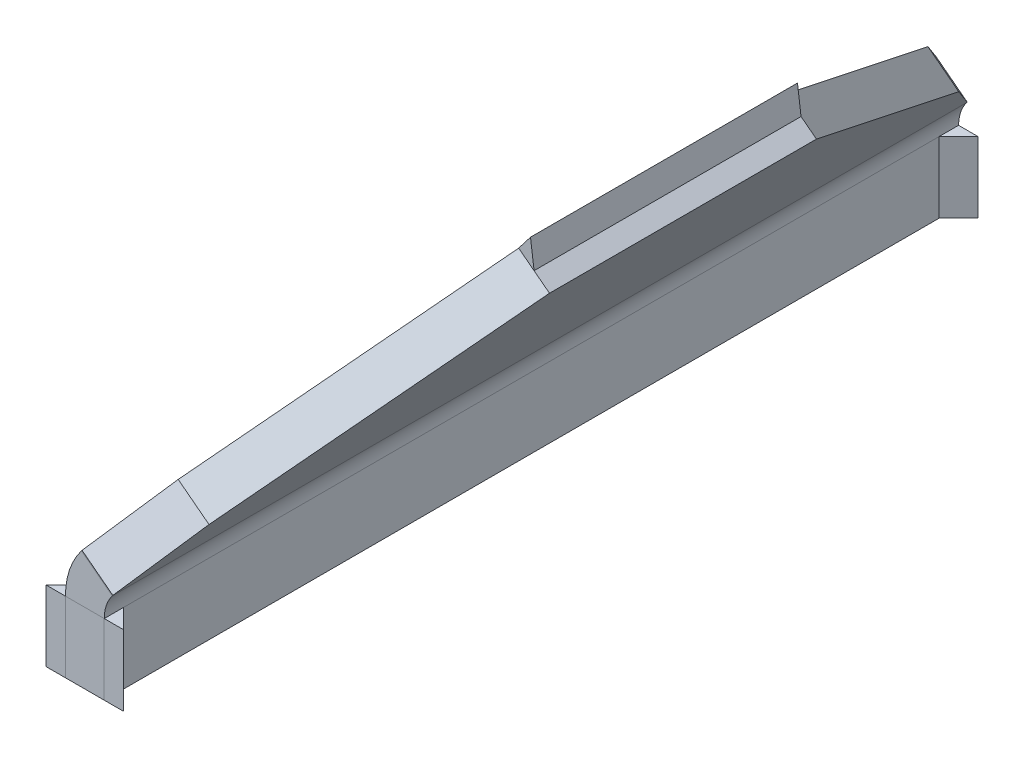
ISO-10303-21;
HEADER;
FILE_DESCRIPTION(('STEP AP214'),'2;1');
FILE_NAME('part.step','',(''),(''),'','','');
FILE_SCHEMA(('AUTOMOTIVE_DESIGN { 1 0 10303 214 1 1 1 1 }'));
ENDSEC;
DATA;
#1=APPLICATION_CONTEXT('core data for automotive mechanical design processes');
#2=APPLICATION_PROTOCOL_DEFINITION('international standard','automotive_design',2000,#1);
#3=PRODUCT_CONTEXT('',#1,'mechanical');
#4=PRODUCT('Part','Part','',(#3));
#5=PRODUCT_RELATED_PRODUCT_CATEGORY('part','',(#4));
#6=PRODUCT_DEFINITION_FORMATION('','',#4);
#7=PRODUCT_DEFINITION_CONTEXT('part definition',#1,'design');
#8=PRODUCT_DEFINITION('design','',#6,#7);
#9=PRODUCT_DEFINITION_SHAPE('','',#8);
#10=(LENGTH_UNIT() NAMED_UNIT(*) SI_UNIT(.MILLI.,.METRE.));
#11=(NAMED_UNIT(*) PLANE_ANGLE_UNIT() SI_UNIT($,.RADIAN.));
#12=(NAMED_UNIT(*) SI_UNIT($,.STERADIAN.) SOLID_ANGLE_UNIT());
#13=UNCERTAINTY_MEASURE_WITH_UNIT(LENGTH_MEASURE(1.E-05),#10,'distance_accuracy_value','');
#14=(GEOMETRIC_REPRESENTATION_CONTEXT(3) GLOBAL_UNCERTAINTY_ASSIGNED_CONTEXT((#13)) GLOBAL_UNIT_ASSIGNED_CONTEXT((#10,
#11,#12)) REPRESENTATION_CONTEXT('',''));
#15=CARTESIAN_POINT('',(0.,0.,0.));
#16=DIRECTION('',(0.,0.,1.));
#17=DIRECTION('',(1.,0.,0.));
#18=AXIS2_PLACEMENT_3D('',#15,#16,#17);
#19=CARTESIAN_POINT('',(0.,7.28436592909285,-42.));
#20=DIRECTION('',(-0.707106781186548,0.,0.707106781186547));
#21=DIRECTION('',(0.707106781186547,0.,0.707106781186548));
#22=AXIS2_PLACEMENT_3D('',#19,#20,#21);
#23=PLANE('',#22);
#24=DIRECTION('',(-0.707106781186547,0.,-0.707106781186548));
#25=VECTOR('',#24,1.);
#26=CARTESIAN_POINT('',(0.,-1.38777878078145E-13,-42.));
#27=LINE('',#26,#25);
#28=CARTESIAN_POINT('',(0.,-1.38777878078145E-13,-42.));
#29=VERTEX_POINT('',#28);
#30=CARTESIAN_POINT('',(-2.,0.,-44.));
#31=VERTEX_POINT('',#30);
#32=EDGE_CURVE('E101',#29,#31,#27,.T.);
#33=ORIENTED_EDGE('',*,*,#32,.F.);
#34=DIRECTION('',(0.,-1.,0.));
#35=VECTOR('',#34,1.);
#36=CARTESIAN_POINT('',(0.,7.28436592909285,-42.));
#37=LINE('',#36,#35);
#38=CARTESIAN_POINT('',(0.,7.28436592909285,-42.));
#39=VERTEX_POINT('',#38);
#40=EDGE_CURVE('E12',#39,#29,#37,.T.);
#41=ORIENTED_EDGE('',*,*,#40,.F.);
#42=DIRECTION('',(-0.707106781186547,0.,-0.707106781186548));
#43=VECTOR('',#42,1.);
#44=CARTESIAN_POINT('',(0.,7.28436592909285,-42.));
#45=LINE('',#44,#43);
#46=CARTESIAN_POINT('',(-1.99999999999999,7.28436592909298,-44.));
#47=VERTEX_POINT('',#46);
#48=EDGE_CURVE('E93',#39,#47,#45,.T.);
#49=ORIENTED_EDGE('',*,*,#48,.T.);
#50=DIRECTION('',(0.,-1.,0.));
#51=VECTOR('',#50,1.);
#52=CARTESIAN_POINT('',(-1.99999999999999,7.28436592909298,-44.));
#53=LINE('',#52,#51);
#54=EDGE_CURVE('E52',#47,#31,#53,.T.);
#55=ORIENTED_EDGE('',*,*,#54,.T.);
#56=EDGE_LOOP('',(#33,#41,#49,#55));
#57=FACE_BOUND('',#56,.T.);
#58=ADVANCED_FACE('F49',(#57),#23,.T.);
#59=CARTESIAN_POINT('',(0.,7.28436592909298,-44.));
#60=DIRECTION('',(1.,0.,0.));
#61=DIRECTION('',(0.,0.,-1.));
#62=AXIS2_PLACEMENT_3D('',#59,#60,#61);
#63=PLANE('',#62);
#64=DIRECTION('',(0.,0.,1.));
#65=VECTOR('',#64,1.);
#66=CARTESIAN_POINT('',(0.,-1.38777878078145E-13,-44.));
#67=LINE('',#66,#65);
#68=CARTESIAN_POINT('',(0.,-1.38777878078145E-13,-44.));
#69=VERTEX_POINT('',#68);
#70=EDGE_CURVE('E95',#69,#29,#67,.T.);
#71=ORIENTED_EDGE('',*,*,#70,.F.);
#72=DIRECTION('',(0.,-1.,0.));
#73=VECTOR('',#72,1.);
#74=CARTESIAN_POINT('',(0.,7.28436592909298,-44.));
#75=LINE('',#74,#73);
#76=CARTESIAN_POINT('',(0.,7.28436592909298,-44.));
#77=VERTEX_POINT('',#76);
#78=EDGE_CURVE('E58',#77,#69,#75,.T.);
#79=ORIENTED_EDGE('',*,*,#78,.F.);
#80=DIRECTION('',(0.,0.,1.));
#81=VECTOR('',#80,1.);
#82=CARTESIAN_POINT('',(0.,7.28436592909298,-44.));
#83=LINE('',#82,#81);
#84=EDGE_CURVE('E90',#77,#39,#83,.T.);
#85=ORIENTED_EDGE('',*,*,#84,.T.);
#86=ORIENTED_EDGE('',*,*,#40,.T.);
#87=EDGE_LOOP('',(#71,#79,#85,#86));
#88=FACE_BOUND('',#87,.T.);
#89=ADVANCED_FACE('F105',(#88),#63,.T.);
#90=CARTESIAN_POINT('',(-1.99999999999999,7.28436592909298,-44.));
#91=DIRECTION('',(0.,0.,-1.));
#92=DIRECTION('',(-1.,0.,0.));
#93=AXIS2_PLACEMENT_3D('',#90,#91,#92);
#94=PLANE('',#93);
#95=DIRECTION('',(1.,0.,0.));
#96=VECTOR('',#95,1.);
#97=CARTESIAN_POINT('',(-2.,0.,-44.));
#98=LINE('',#97,#96);
#99=EDGE_CURVE('E88',#31,#69,#98,.T.);
#100=ORIENTED_EDGE('',*,*,#99,.F.);
#101=ORIENTED_EDGE('',*,*,#54,.F.);
#102=DIRECTION('',(1.,0.,0.));
#103=VECTOR('',#102,1.);
#104=CARTESIAN_POINT('',(-1.99999999999999,7.28436592909298,-44.));
#105=LINE('',#104,#103);
#106=EDGE_CURVE('E86',#47,#77,#105,.T.);
#107=ORIENTED_EDGE('',*,*,#106,.T.);
#108=ORIENTED_EDGE('',*,*,#78,.T.);
#109=EDGE_LOOP('',(#100,#101,#107,#108));
#110=FACE_BOUND('',#109,.T.);
#111=ADVANCED_FACE('F85',(#110),#94,.T.);
#112=CARTESIAN_POINT('',(-1.99999999999999,7.28436592909298,-44.));
#113=DIRECTION('',(0.,-1.,0.));
#114=DIRECTION('',(0.,0.,-1.));
#115=AXIS2_PLACEMENT_3D('',#112,#113,#114);
#116=PLANE('',#115);
#117=ORIENTED_EDGE('',*,*,#48,.F.);
#118=ORIENTED_EDGE('',*,*,#84,.F.);
#119=ORIENTED_EDGE('',*,*,#106,.F.);
#120=EDGE_LOOP('',(#117,#118,#119));
#121=FACE_BOUND('',#120,.T.);
#122=ADVANCED_FACE('F92',(#121),#116,.F.);
#123=CARTESIAN_POINT('',(-2.,0.,-44.));
#124=DIRECTION('',(0.,-1.,0.));
#125=DIRECTION('',(0.,0.,-1.));
#126=AXIS2_PLACEMENT_3D('',#123,#124,#125);
#127=PLANE('',#126);
#128=ORIENTED_EDGE('',*,*,#32,.T.);
#129=ORIENTED_EDGE('',*,*,#99,.T.);
#130=ORIENTED_EDGE('',*,*,#70,.T.);
#131=EDGE_LOOP('',(#128,#129,#130));
#132=FACE_BOUND('',#131,.T.);
#133=ADVANCED_FACE('F104',(#132),#127,.T.);
#134=CLOSED_SHELL('',(#58,#89,#111,#122,#133));
#135=MANIFOLD_SOLID_BREP('B2',#134);
#136=CARTESIAN_POINT('',(6.,7.28436592909299,-43.9999999999999));
#137=DIRECTION('',(0.,0.,-1.));
#138=DIRECTION('',(-1.,0.,0.));
#139=AXIS2_PLACEMENT_3D('',#136,#137,#138);
#140=PLANE('',#139);
#141=DIRECTION('',(1.,0.,0.));
#142=VECTOR('',#141,1.);
#143=CARTESIAN_POINT('',(6.,0.,-44.));
#144=LINE('',#143,#142);
#145=CARTESIAN_POINT('',(4.,0.,-44.));
#146=VERTEX_POINT('',#145);
#147=CARTESIAN_POINT('',(6.,0.,-44.));
#148=VERTEX_POINT('',#147);
#149=EDGE_CURVE('E208',#146,#148,#144,.T.);
#150=ORIENTED_EDGE('',*,*,#149,.F.);
#151=DIRECTION('',(0.,-1.,0.));
#152=VECTOR('',#151,1.);
#153=CARTESIAN_POINT('',(4.,7.28436592909299,-43.9999999999999));
#154=LINE('',#153,#152);
#155=CARTESIAN_POINT('',(4.,7.28436592909299,-43.9999999999999));
#156=VERTEX_POINT('',#155);
#157=EDGE_CURVE('E47',#156,#146,#154,.T.);
#158=ORIENTED_EDGE('',*,*,#157,.F.);
#159=DIRECTION('',(1.,0.,0.));
#160=VECTOR('',#159,1.);
#161=CARTESIAN_POINT('',(6.,7.28436592909299,-43.9999999999999));
#162=LINE('',#161,#160);
#163=CARTESIAN_POINT('',(6.,7.28436592909299,-43.9999999999999));
#164=VERTEX_POINT('',#163);
#165=EDGE_CURVE('E200',#156,#164,#162,.T.);
#166=ORIENTED_EDGE('',*,*,#165,.T.);
#167=DIRECTION('',(0.,-1.,0.));
#168=VECTOR('',#167,1.);
#169=CARTESIAN_POINT('',(6.,7.28436592909299,-43.9999999999999));
#170=LINE('',#169,#168);
#171=EDGE_CURVE('E159',#164,#148,#170,.T.);
#172=ORIENTED_EDGE('',*,*,#171,.T.);
#173=EDGE_LOOP('',(#150,#158,#166,#172));
#174=FACE_BOUND('',#173,.T.);
#175=ADVANCED_FACE('F156',(#174),#140,.T.);
#176=CARTESIAN_POINT('',(4.,7.28436592909299,-43.9999999999999));
#177=DIRECTION('',(-1.,0.,0.));
#178=DIRECTION('',(0.,0.,1.));
#179=AXIS2_PLACEMENT_3D('',#176,#177,#178);
#180=PLANE('',#179);
#181=DIRECTION('',(0.,0.,-1.));
#182=VECTOR('',#181,1.);
#183=CARTESIAN_POINT('',(4.,0.,-44.));
#184=LINE('',#183,#182);
#185=CARTESIAN_POINT('',(4.,0.,-42.));
#186=VERTEX_POINT('',#185);
#187=EDGE_CURVE('E202',#186,#146,#184,.T.);
#188=ORIENTED_EDGE('',*,*,#187,.F.);
#189=DIRECTION('',(0.,-1.,0.));
#190=VECTOR('',#189,1.);
#191=CARTESIAN_POINT('',(4.,7.28436592909299,-41.9999999999999));
#192=LINE('',#191,#190);
#193=CARTESIAN_POINT('',(4.,7.28436592909299,-41.9999999999999));
#194=VERTEX_POINT('',#193);
#195=EDGE_CURVE('E165',#194,#186,#192,.T.);
#196=ORIENTED_EDGE('',*,*,#195,.F.);
#197=DIRECTION('',(0.,0.,-1.));
#198=VECTOR('',#197,1.);
#199=CARTESIAN_POINT('',(4.,7.28436592909299,-43.9999999999999));
#200=LINE('',#199,#198);
#201=EDGE_CURVE('E197',#194,#156,#200,.T.);
#202=ORIENTED_EDGE('',*,*,#201,.T.);
#203=ORIENTED_EDGE('',*,*,#157,.T.);
#204=EDGE_LOOP('',(#188,#196,#202,#203));
#205=FACE_BOUND('',#204,.T.);
#206=ADVANCED_FACE('F212',(#205),#180,.T.);
#207=CARTESIAN_POINT('',(4.,7.28436592909299,-41.9999999999999));
#208=DIRECTION('',(0.707106781186548,0.,0.707106781186548));
#209=DIRECTION('',(0.707106781186547,0.,-0.707106781186548));
#210=AXIS2_PLACEMENT_3D('',#207,#208,#209);
#211=PLANE('',#210);
#212=DIRECTION('',(-0.707106781186547,0.,0.707106781186548));
#213=VECTOR('',#212,1.);
#214=CARTESIAN_POINT('',(4.,0.,-42.));
#215=LINE('',#214,#213);
#216=EDGE_CURVE('E195',#148,#186,#215,.T.);
#217=ORIENTED_EDGE('',*,*,#216,.F.);
#218=ORIENTED_EDGE('',*,*,#171,.F.);
#219=DIRECTION('',(-0.707106781186547,0.,0.707106781186548));
#220=VECTOR('',#219,1.);
#221=CARTESIAN_POINT('',(4.,7.28436592909299,-41.9999999999999));
#222=LINE('',#221,#220);
#223=EDGE_CURVE('E193',#164,#194,#222,.T.);
#224=ORIENTED_EDGE('',*,*,#223,.T.);
#225=ORIENTED_EDGE('',*,*,#195,.T.);
#226=EDGE_LOOP('',(#217,#218,#224,#225));
#227=FACE_BOUND('',#226,.T.);
#228=ADVANCED_FACE('F192',(#227),#211,.T.);
#229=CARTESIAN_POINT('',(4.,7.28436592909299,-43.9999999999999));
#230=DIRECTION('',(0.,1.,0.));
#231=DIRECTION('',(0.,0.,1.));
#232=AXIS2_PLACEMENT_3D('',#229,#230,#231);
#233=PLANE('',#232);
#234=ORIENTED_EDGE('',*,*,#165,.F.);
#235=ORIENTED_EDGE('',*,*,#201,.F.);
#236=ORIENTED_EDGE('',*,*,#223,.F.);
#237=EDGE_LOOP('',(#234,#235,#236));
#238=FACE_BOUND('',#237,.T.);
#239=ADVANCED_FACE('F199',(#238),#233,.T.);
#240=CARTESIAN_POINT('',(4.,0.,-44.));
#241=DIRECTION('',(0.,1.,0.));
#242=DIRECTION('',(0.,0.,1.));
#243=AXIS2_PLACEMENT_3D('',#240,#241,#242);
#244=PLANE('',#243);
#245=ORIENTED_EDGE('',*,*,#149,.T.);
#246=ORIENTED_EDGE('',*,*,#216,.T.);
#247=ORIENTED_EDGE('',*,*,#187,.T.);
#248=EDGE_LOOP('',(#245,#246,#247));
#249=FACE_BOUND('',#248,.T.);
#250=ADVANCED_FACE('F211',(#249),#244,.F.);
#251=CLOSED_SHELL('',(#175,#206,#228,#239,#250));
#252=MANIFOLD_SOLID_BREP('B6',#251);
#253=CARTESIAN_POINT('',(3.99999999999999,7.28436592909299,42.));
#254=DIRECTION('',(0.707106781186548,0.,-0.707106781186548));
#255=DIRECTION('',(-0.707106781186547,0.,-0.707106781186548));
#256=AXIS2_PLACEMENT_3D('',#253,#254,#255);
#257=PLANE('',#256);
#258=DIRECTION('',(0.707106781186547,0.,0.707106781186548));
#259=VECTOR('',#258,1.);
#260=CARTESIAN_POINT('',(3.99999999999986,0.,42.));
#261=LINE('',#260,#259);
#262=CARTESIAN_POINT('',(3.99999999999986,0.,42.));
#263=VERTEX_POINT('',#262);
#264=CARTESIAN_POINT('',(5.99999999999986,0.,44.));
#265=VERTEX_POINT('',#264);
#266=EDGE_CURVE('E315',#263,#265,#261,.T.);
#267=ORIENTED_EDGE('',*,*,#266,.F.);
#268=DIRECTION('',(0.,-1.,0.));
#269=VECTOR('',#268,1.);
#270=CARTESIAN_POINT('',(3.99999999999999,7.28436592909299,42.));
#271=LINE('',#270,#269);
#272=CARTESIAN_POINT('',(3.99999999999999,7.28436592909299,42.));
#273=VERTEX_POINT('',#272);
#274=EDGE_CURVE('E154',#273,#263,#271,.T.);
#275=ORIENTED_EDGE('',*,*,#274,.F.);
#276=DIRECTION('',(0.707106781186547,0.,0.707106781186548));
#277=VECTOR('',#276,1.);
#278=CARTESIAN_POINT('',(3.99999999999999,7.28436592909299,42.));
#279=LINE('',#278,#277);
#280=CARTESIAN_POINT('',(5.99999999999999,7.28436592909299,44.));
#281=VERTEX_POINT('',#280);
#282=EDGE_CURVE('E307',#273,#281,#279,.T.);
#283=ORIENTED_EDGE('',*,*,#282,.T.);
#284=DIRECTION('',(0.,-1.,0.));
#285=VECTOR('',#284,1.);
#286=CARTESIAN_POINT('',(5.99999999999999,7.28436592909299,44.));
#287=LINE('',#286,#285);
#288=EDGE_CURVE('E266',#281,#265,#287,.T.);
#289=ORIENTED_EDGE('',*,*,#288,.T.);
#290=EDGE_LOOP('',(#267,#275,#283,#289));
#291=FACE_BOUND('',#290,.T.);
#292=ADVANCED_FACE('F263',(#291),#257,.T.);
#293=CARTESIAN_POINT('',(3.99999999999999,7.28436592909299,44.));
#294=DIRECTION('',(-1.,0.,0.));
#295=DIRECTION('',(0.,0.,1.));
#296=AXIS2_PLACEMENT_3D('',#293,#294,#295);
#297=PLANE('',#296);
#298=DIRECTION('',(0.,0.,-1.));
#299=VECTOR('',#298,1.);
#300=CARTESIAN_POINT('',(3.99999999999986,0.,44.));
#301=LINE('',#300,#299);
#302=CARTESIAN_POINT('',(3.99999999999986,0.,44.));
#303=VERTEX_POINT('',#302);
#304=EDGE_CURVE('E309',#303,#263,#301,.T.);
#305=ORIENTED_EDGE('',*,*,#304,.F.);
#306=DIRECTION('',(0.,-1.,0.));
#307=VECTOR('',#306,1.);
#308=CARTESIAN_POINT('',(3.99999999999999,7.28436592909299,44.));
#309=LINE('',#308,#307);
#310=CARTESIAN_POINT('',(3.99999999999999,7.28436592909299,44.));
#311=VERTEX_POINT('',#310);
#312=EDGE_CURVE('E272',#311,#303,#309,.T.);
#313=ORIENTED_EDGE('',*,*,#312,.F.);
#314=DIRECTION('',(0.,0.,-1.));
#315=VECTOR('',#314,1.);
#316=CARTESIAN_POINT('',(3.99999999999999,7.28436592909299,44.));
#317=LINE('',#316,#315);
#318=EDGE_CURVE('E304',#311,#273,#317,.T.);
#319=ORIENTED_EDGE('',*,*,#318,.T.);
#320=ORIENTED_EDGE('',*,*,#274,.T.);
#321=EDGE_LOOP('',(#305,#313,#319,#320));
#322=FACE_BOUND('',#321,.T.);
#323=ADVANCED_FACE('F319',(#322),#297,.T.);
#324=CARTESIAN_POINT('',(5.99999999999999,7.28436592909299,44.));
#325=DIRECTION('',(0.,0.,1.));
#326=DIRECTION('',(1.,0.,0.));
#327=AXIS2_PLACEMENT_3D('',#324,#325,#326);
#328=PLANE('',#327);
#329=DIRECTION('',(-1.,0.,0.));
#330=VECTOR('',#329,1.);
#331=CARTESIAN_POINT('',(5.99999999999986,0.,44.));
#332=LINE('',#331,#330);
#333=EDGE_CURVE('E302',#265,#303,#332,.T.);
#334=ORIENTED_EDGE('',*,*,#333,.F.);
#335=ORIENTED_EDGE('',*,*,#288,.F.);
#336=DIRECTION('',(-1.,0.,0.));
#337=VECTOR('',#336,1.);
#338=CARTESIAN_POINT('',(5.99999999999999,7.28436592909299,44.));
#339=LINE('',#338,#337);
#340=EDGE_CURVE('E300',#281,#311,#339,.T.);
#341=ORIENTED_EDGE('',*,*,#340,.T.);
#342=ORIENTED_EDGE('',*,*,#312,.T.);
#343=EDGE_LOOP('',(#334,#335,#341,#342));
#344=FACE_BOUND('',#343,.T.);
#345=ADVANCED_FACE('F299',(#344),#328,.T.);
#346=CARTESIAN_POINT('',(5.99999999999999,7.28436592909299,44.));
#347=DIRECTION('',(0.,-1.,0.));
#348=DIRECTION('',(0.,0.,-1.));
#349=AXIS2_PLACEMENT_3D('',#346,#347,#348);
#350=PLANE('',#349);
#351=ORIENTED_EDGE('',*,*,#282,.F.);
#352=ORIENTED_EDGE('',*,*,#318,.F.);
#353=ORIENTED_EDGE('',*,*,#340,.F.);
#354=EDGE_LOOP('',(#351,#352,#353));
#355=FACE_BOUND('',#354,.T.);
#356=ADVANCED_FACE('F306',(#355),#350,.F.);
#357=CARTESIAN_POINT('',(5.99999999999986,0.,44.));
#358=DIRECTION('',(0.,-1.,0.));
#359=DIRECTION('',(0.,0.,-1.));
#360=AXIS2_PLACEMENT_3D('',#357,#358,#359);
#361=PLANE('',#360);
#362=ORIENTED_EDGE('',*,*,#266,.T.);
#363=ORIENTED_EDGE('',*,*,#333,.T.);
#364=ORIENTED_EDGE('',*,*,#304,.T.);
#365=EDGE_LOOP('',(#362,#363,#364));
#366=FACE_BOUND('',#365,.T.);
#367=ADVANCED_FACE('F318',(#366),#361,.T.);
#368=CLOSED_SHELL('',(#292,#323,#345,#356,#367));
#369=MANIFOLD_SOLID_BREP('B41',#368);
#370=CARTESIAN_POINT('',(-2.,7.28436592909298,44.));
#371=DIRECTION('',(0.,0.,1.));
#372=DIRECTION('',(1.,0.,0.));
#373=AXIS2_PLACEMENT_3D('',#370,#371,#372);
#374=PLANE('',#373);
#375=DIRECTION('',(-1.,0.,0.));
#376=VECTOR('',#375,1.);
#377=CARTESIAN_POINT('',(-2.00000000000014,0.,44.));
#378=LINE('',#377,#376);
#379=CARTESIAN_POINT('',(-1.38777878078145E-13,0.,44.));
#380=VERTEX_POINT('',#379);
#381=CARTESIAN_POINT('',(-2.00000000000014,0.,44.));
#382=VERTEX_POINT('',#381);
#383=EDGE_CURVE('E422',#380,#382,#378,.T.);
#384=ORIENTED_EDGE('',*,*,#383,.F.);
#385=DIRECTION('',(0.,-1.,0.));
#386=VECTOR('',#385,1.);
#387=CARTESIAN_POINT('',(-1.38777878078145E-13,7.28436592909298,44.));
#388=LINE('',#387,#386);
#389=CARTESIAN_POINT('',(-1.38777878078145E-13,7.28436592909298,44.));
#390=VERTEX_POINT('',#389);
#391=EDGE_CURVE('E261',#390,#380,#388,.T.);
#392=ORIENTED_EDGE('',*,*,#391,.F.);
#393=DIRECTION('',(-1.,0.,0.));
#394=VECTOR('',#393,1.);
#395=CARTESIAN_POINT('',(-2.,7.28436592909298,44.));
#396=LINE('',#395,#394);
#397=CARTESIAN_POINT('',(-2.,7.28436592909298,44.));
#398=VERTEX_POINT('',#397);
#399=EDGE_CURVE('E414',#390,#398,#396,.T.);
#400=ORIENTED_EDGE('',*,*,#399,.T.);
#401=DIRECTION('',(0.,-1.,0.));
#402=VECTOR('',#401,1.);
#403=CARTESIAN_POINT('',(-2.,7.28436592909298,44.));
#404=LINE('',#403,#402);
#405=EDGE_CURVE('E373',#398,#382,#404,.T.);
#406=ORIENTED_EDGE('',*,*,#405,.T.);
#407=EDGE_LOOP('',(#384,#392,#400,#406));
#408=FACE_BOUND('',#407,.T.);
#409=ADVANCED_FACE('F370',(#408),#374,.T.);
#410=CARTESIAN_POINT('',(-1.38777878078145E-13,7.28436592909298,44.));
#411=DIRECTION('',(1.,0.,0.));
#412=DIRECTION('',(0.,0.,-1.));
#413=AXIS2_PLACEMENT_3D('',#410,#411,#412);
#414=PLANE('',#413);
#415=DIRECTION('',(0.,0.,1.));
#416=VECTOR('',#415,1.);
#417=CARTESIAN_POINT('',(-1.38777878078145E-13,0.,44.));
#418=LINE('',#417,#416);
#419=CARTESIAN_POINT('',(-1.38777878078145E-13,0.,42.));
#420=VERTEX_POINT('',#419);
#421=EDGE_CURVE('E416',#420,#380,#418,.T.);
#422=ORIENTED_EDGE('',*,*,#421,.F.);
#423=DIRECTION('',(0.,-1.,0.));
#424=VECTOR('',#423,1.);
#425=CARTESIAN_POINT('',(0.,7.28436592909298,42.));
#426=LINE('',#425,#424);
#427=CARTESIAN_POINT('',(0.,7.28436592909298,42.));
#428=VERTEX_POINT('',#427);
#429=EDGE_CURVE('E379',#428,#420,#426,.T.);
#430=ORIENTED_EDGE('',*,*,#429,.F.);
#431=DIRECTION('',(0.,0.,1.));
#432=VECTOR('',#431,1.);
#433=CARTESIAN_POINT('',(-1.38777878078145E-13,7.28436592909298,44.));
#434=LINE('',#433,#432);
#435=EDGE_CURVE('E411',#428,#390,#434,.T.);
#436=ORIENTED_EDGE('',*,*,#435,.T.);
#437=ORIENTED_EDGE('',*,*,#391,.T.);
#438=EDGE_LOOP('',(#422,#430,#436,#437));
#439=FACE_BOUND('',#438,.T.);
#440=ADVANCED_FACE('F426',(#439),#414,.T.);
#441=CARTESIAN_POINT('',(0.,7.28436592909298,42.));
#442=DIRECTION('',(-0.707106781186548,0.,-0.707106781186547));
#443=DIRECTION('',(-0.707106781186547,0.,0.707106781186548));
#444=AXIS2_PLACEMENT_3D('',#441,#442,#443);
#445=PLANE('',#444);
#446=DIRECTION('',(0.707106781186547,0.,-0.707106781186548));
#447=VECTOR('',#446,1.);
#448=CARTESIAN_POINT('',(-1.38777878078145E-13,0.,42.));
#449=LINE('',#448,#447);
#450=EDGE_CURVE('E409',#382,#420,#449,.T.);
#451=ORIENTED_EDGE('',*,*,#450,.F.);
#452=ORIENTED_EDGE('',*,*,#405,.F.);
#453=DIRECTION('',(0.707106781186547,0.,-0.707106781186548));
#454=VECTOR('',#453,1.);
#455=CARTESIAN_POINT('',(0.,7.28436592909298,42.));
#456=LINE('',#455,#454);
#457=EDGE_CURVE('E407',#398,#428,#456,.T.);
#458=ORIENTED_EDGE('',*,*,#457,.T.);
#459=ORIENTED_EDGE('',*,*,#429,.T.);
#460=EDGE_LOOP('',(#451,#452,#458,#459));
#461=FACE_BOUND('',#460,.T.);
#462=ADVANCED_FACE('F406',(#461),#445,.T.);
#463=CARTESIAN_POINT('',(-1.38777878078145E-13,7.28436592909298,44.));
#464=DIRECTION('',(0.,1.,0.));
#465=DIRECTION('',(0.,0.,1.));
#466=AXIS2_PLACEMENT_3D('',#463,#464,#465);
#467=PLANE('',#466);
#468=ORIENTED_EDGE('',*,*,#399,.F.);
#469=ORIENTED_EDGE('',*,*,#435,.F.);
#470=ORIENTED_EDGE('',*,*,#457,.F.);
#471=EDGE_LOOP('',(#468,#469,#470));
#472=FACE_BOUND('',#471,.T.);
#473=ADVANCED_FACE('F413',(#472),#467,.T.);
#474=CARTESIAN_POINT('',(-1.38777878078145E-13,0.,44.));
#475=DIRECTION('',(0.,1.,0.));
#476=DIRECTION('',(0.,0.,1.));
#477=AXIS2_PLACEMENT_3D('',#474,#475,#476);
#478=PLANE('',#477);
#479=ORIENTED_EDGE('',*,*,#383,.T.);
#480=ORIENTED_EDGE('',*,*,#450,.T.);
#481=ORIENTED_EDGE('',*,*,#421,.T.);
#482=EDGE_LOOP('',(#479,#480,#481));
#483=FACE_BOUND('',#482,.T.);
#484=ADVANCED_FACE('F425',(#483),#478,.F.);
#485=CLOSED_SHELL('',(#409,#440,#462,#473,#484));
#486=MANIFOLD_SOLID_BREP('B148',#485);
#487=CARTESIAN_POINT('',(17.6540814412529,33.0072468684458,-13.75));
#488=DIRECTION('',(-0.793353340291235,0.608761429008722,0.));
#489=DIRECTION('',(-0.608761429008722,-0.793353340291234,0.));
#490=AXIS2_PLACEMENT_3D('',#487,#488,#489);
#491=PLANE('',#490);
#492=DIRECTION('',(-0.608761429008722,-0.793353340291234,0.));
#493=VECTOR('',#492,1.);
#494=CARTESIAN_POINT('',(17.6540814412529,33.0072468684458,13.75));
#495=LINE('',#494,#493);
#496=CARTESIAN_POINT('',(17.6540814412529,33.0072468684458,13.75));
#497=VERTEX_POINT('',#496);
#498=CARTESIAN_POINT('',(16.4365585832355,31.4205401878633,13.75));
#499=VERTEX_POINT('',#498);
#500=EDGE_CURVE('E528',#497,#499,#495,.T.);
#501=ORIENTED_EDGE('',*,*,#500,.F.);
#502=DIRECTION('',(0.,0.,1.));
#503=VECTOR('',#502,1.);
#504=CARTESIAN_POINT('',(17.6540814412529,33.0072468684458,-13.75));
#505=LINE('',#504,#503);
#506=CARTESIAN_POINT('',(17.6540814412529,33.0072468684458,-13.75));
#507=VERTEX_POINT('',#506);
#508=EDGE_CURVE('E368',#507,#497,#505,.T.);
#509=ORIENTED_EDGE('',*,*,#508,.F.);
#510=DIRECTION('',(-0.608761429008722,-0.793353340291234,0.));
#511=VECTOR('',#510,1.);
#512=CARTESIAN_POINT('',(17.6540814412529,33.0072468684458,-13.75));
#513=LINE('',#512,#511);
#514=CARTESIAN_POINT('',(16.4365585832355,31.4205401878633,-13.75));
#515=VERTEX_POINT('',#514);
#516=EDGE_CURVE('E520',#507,#515,#513,.T.);
#517=ORIENTED_EDGE('',*,*,#516,.T.);
#518=DIRECTION('',(0.,0.,1.));
#519=VECTOR('',#518,1.);
#520=CARTESIAN_POINT('',(16.4365585832355,31.4205401878633,-13.75));
#521=LINE('',#520,#519);
#522=EDGE_CURVE('E479',#515,#499,#521,.T.);
#523=ORIENTED_EDGE('',*,*,#522,.T.);
#524=EDGE_LOOP('',(#501,#509,#517,#523));
#525=FACE_BOUND('',#524,.T.);
#526=ADVANCED_FACE('F476',(#525),#491,.T.);
#527=CARTESIAN_POINT('',(18.0232652638178,30.2030173298459,-13.75));
#528=DIRECTION('',(0.991444861373811,0.130526192220051,0.));
#529=DIRECTION('',(-0.13052619222005,0.99144486137381,0.));
#530=AXIS2_PLACEMENT_3D('',#527,#528,#529);
#531=PLANE('',#530);
#532=DIRECTION('',(-0.13052619222005,0.991444861373811,0.));
#533=VECTOR('',#532,1.);
#534=CARTESIAN_POINT('',(18.0232652638178,30.2030173298459,13.75));
#535=LINE('',#534,#533);
#536=CARTESIAN_POINT('',(18.0232652638178,30.2030173298459,13.75));
#537=VERTEX_POINT('',#536);
#538=EDGE_CURVE('E522',#537,#497,#535,.T.);
#539=ORIENTED_EDGE('',*,*,#538,.F.);
#540=DIRECTION('',(0.,0.,1.));
#541=VECTOR('',#540,1.);
#542=CARTESIAN_POINT('',(18.0232652638178,30.2030173298459,-13.75));
#543=LINE('',#542,#541);
#544=CARTESIAN_POINT('',(18.0232652638178,30.2030173298459,-13.75));
#545=VERTEX_POINT('',#544);
#546=EDGE_CURVE('E485',#545,#537,#543,.T.);
#547=ORIENTED_EDGE('',*,*,#546,.F.);
#548=DIRECTION('',(-0.13052619222005,0.991444861373811,0.));
#549=VECTOR('',#548,1.);
#550=CARTESIAN_POINT('',(18.0232652638178,30.2030173298459,-13.75));
#551=LINE('',#550,#549);
#552=EDGE_CURVE('E517',#545,#507,#551,.T.);
#553=ORIENTED_EDGE('',*,*,#552,.T.);
#554=ORIENTED_EDGE('',*,*,#508,.T.);
#555=EDGE_LOOP('',(#539,#547,#553,#554));
#556=FACE_BOUND('',#555,.T.);
#557=ADVANCED_FACE('F532',(#556),#531,.T.);
#558=CARTESIAN_POINT('',(16.4365585832355,31.4205401878633,-13.75));
#559=DIRECTION('',(-0.608761429008722,-0.793353340291235,0.));
#560=DIRECTION('',(0.793353340291234,-0.608761429008722,0.));
#561=AXIS2_PLACEMENT_3D('',#558,#559,#560);
#562=PLANE('',#561);
#563=DIRECTION('',(0.793353340291234,-0.608761429008722,0.));
#564=VECTOR('',#563,1.);
#565=CARTESIAN_POINT('',(16.4365585832355,31.4205401878633,13.75));
#566=LINE('',#565,#564);
#567=EDGE_CURVE('E515',#499,#537,#566,.T.);
#568=ORIENTED_EDGE('',*,*,#567,.F.);
#569=ORIENTED_EDGE('',*,*,#522,.F.);
#570=DIRECTION('',(0.793353340291234,-0.608761429008722,0.));
#571=VECTOR('',#570,1.);
#572=CARTESIAN_POINT('',(16.4365585832355,31.4205401878633,-13.75));
#573=LINE('',#572,#571);
#574=EDGE_CURVE('E513',#515,#545,#573,.T.);
#575=ORIENTED_EDGE('',*,*,#574,.T.);
#576=ORIENTED_EDGE('',*,*,#546,.T.);
#577=EDGE_LOOP('',(#568,#569,#575,#576));
#578=FACE_BOUND('',#577,.T.);
#579=ADVANCED_FACE('F512',(#578),#562,.T.);
#580=CARTESIAN_POINT('',(16.4365585832355,31.4205401878633,-13.75));
#581=DIRECTION('',(0.,0.,1.));
#582=DIRECTION('',(1.,0.,0.));
#583=AXIS2_PLACEMENT_3D('',#580,#581,#582);
#584=PLANE('',#583);
#585=ORIENTED_EDGE('',*,*,#516,.F.);
#586=ORIENTED_EDGE('',*,*,#552,.F.);
#587=ORIENTED_EDGE('',*,*,#574,.F.);
#588=EDGE_LOOP('',(#585,#586,#587));
#589=FACE_BOUND('',#588,.T.);
#590=ADVANCED_FACE('F519',(#589),#584,.F.);
#591=CARTESIAN_POINT('',(16.4365585832355,31.4205401878633,13.75));
#592=DIRECTION('',(0.,0.,1.));
#593=DIRECTION('',(1.,0.,0.));
#594=AXIS2_PLACEMENT_3D('',#591,#592,#593);
#595=PLANE('',#594);
#596=ORIENTED_EDGE('',*,*,#500,.T.);
#597=ORIENTED_EDGE('',*,*,#567,.T.);
#598=ORIENTED_EDGE('',*,*,#538,.T.);
#599=EDGE_LOOP('',(#596,#597,#598));
#600=FACE_BOUND('',#599,.T.);
#601=ADVANCED_FACE('F531',(#600),#595,.T.);
#602=CLOSED_SHELL('',(#526,#557,#579,#590,#601));
#603=MANIFOLD_SOLID_BREP('B255',#602);
#604=CARTESIAN_POINT('',(0.,7.28436592909298,-44.));
#605=DIRECTION('',(0.,0.,-1.));
#606=DIRECTION('',(-1.,0.,0.));
#607=AXIS2_PLACEMENT_3D('',#604,#605,#606);
#608=PLANE('',#607);
#609=DIRECTION('',(1.,0.,0.));
#610=VECTOR('',#609,1.);
#611=CARTESIAN_POINT('',(0.,7.28436592909298,-44.));
#612=LINE('',#611,#610);
#613=CARTESIAN_POINT('',(0.,7.28436592909298,-44.));
#614=VERTEX_POINT('',#613);
#615=CARTESIAN_POINT('',(4.,7.28436592909299,-43.9999999999999));
#616=VERTEX_POINT('',#615);
#617=EDGE_CURVE('E760',#614,#616,#612,.T.);
#618=ORIENTED_EDGE('',*,*,#617,.F.);
#619=CARTESIAN_POINT('',(8.,7.28436592909298,-43.9999999999999));
#620=DIRECTION('',(0.,0.,1.));
#621=DIRECTION('',(1.,0.,0.));
#622=AXIS2_PLACEMENT_3D('',#619,#620,#621);
#623=CIRCLE('',#622,8.);
#624=CARTESIAN_POINT('',(1.65317327767012,12.1544573611628,-43.9999999999999));
#625=VERTEX_POINT('',#624);
#626=EDGE_CURVE('E702',#614,#625,#623,.F.);
#627=ORIENTED_EDGE('',*,*,#626,.T.);
#628=DIRECTION('',(-0.793353340291234,0.608761429008722,0.));
#629=VECTOR('',#628,1.);
#630=CARTESIAN_POINT('',(4.82658663883506,9.71941164512788,-43.9999999999999));
#631=LINE('',#630,#629);
#632=CARTESIAN_POINT('',(4.82658663883506,9.71941164512788,-43.9999999999999));
#633=VERTEX_POINT('',#632);
#634=EDGE_CURVE('E758',#633,#625,#631,.T.);
#635=ORIENTED_EDGE('',*,*,#634,.F.);
#636=CARTESIAN_POINT('',(8.,7.28436592909298,-43.9999999999999));
#637=DIRECTION('',(0.,0.,1.));
#638=DIRECTION('',(1.,0.,0.));
#639=AXIS2_PLACEMENT_3D('',#636,#637,#638);
#640=CIRCLE('',#639,4.);
#641=EDGE_CURVE('E713',#616,#633,#640,.F.);
#642=ORIENTED_EDGE('',*,*,#641,.F.);
#643=EDGE_LOOP('',(#618,#627,#635,#642));
#644=FACE_BOUND('',#643,.T.);
#645=ADVANCED_FACE('F573',(#644),#608,.T.);
#646=CARTESIAN_POINT('',(4.82658663883506,9.71941164512788,-43.9999999999999));
#647=DIRECTION('',(0.,0.,-1.));
#648=DIRECTION('',(-1.,0.,0.));
#649=AXIS2_PLACEMENT_3D('',#646,#647,#648);
#650=PLANE('',#649);
#651=DIRECTION('',(0.,1.,0.));
#652=VECTOR('',#651,1.);
#653=CARTESIAN_POINT('',(0.,-1.38777878078145E-13,-44.));
#654=LINE('',#653,#652);
#655=CARTESIAN_POINT('',(0.,-1.38777878078145E-13,-44.));
#656=VERTEX_POINT('',#655);
#657=EDGE_CURVE('E705',#656,#614,#654,.T.);
#658=ORIENTED_EDGE('',*,*,#657,.T.);
#659=ORIENTED_EDGE('',*,*,#617,.T.);
#660=DIRECTION('',(0.,1.,0.));
#661=VECTOR('',#660,1.);
#662=CARTESIAN_POINT('',(4.,0.,-44.));
#663=LINE('',#662,#661);
#664=CARTESIAN_POINT('',(4.,0.,-44.));
#665=VERTEX_POINT('',#664);
#666=EDGE_CURVE('E710',#665,#616,#663,.T.);
#667=ORIENTED_EDGE('',*,*,#666,.F.);
#668=DIRECTION('',(-1.,0.,0.));
#669=VECTOR('',#668,1.);
#670=CARTESIAN_POINT('',(4.,0.,-44.));
#671=LINE('',#670,#669);
#672=EDGE_CURVE('E708',#665,#656,#671,.T.);
#673=ORIENTED_EDGE('',*,*,#672,.T.);
#674=EDGE_LOOP('',(#658,#659,#667,#673));
#675=FACE_BOUND('',#674,.T.);
#676=ADVANCED_FACE('F806',(#675),#650,.T.);
#677=CARTESIAN_POINT('',(1.65317327766999,12.1544573611628,44.));
#678=DIRECTION('',(0.,0.,1.));
#679=DIRECTION('',(1.,0.,0.));
#680=AXIS2_PLACEMENT_3D('',#677,#678,#679);
#681=PLANE('',#680);
#682=DIRECTION('',(0.793353340291234,-0.608761429008722,0.));
#683=VECTOR('',#682,1.);
#684=CARTESIAN_POINT('',(1.65317327766999,12.1544573611628,44.));
#685=LINE('',#684,#683);
#686=CARTESIAN_POINT('',(1.65317327766999,12.1544573611628,44.));
#687=VERTEX_POINT('',#686);
#688=CARTESIAN_POINT('',(4.82658663883506,9.71941164512788,44.));
#689=VERTEX_POINT('',#688);
#690=EDGE_CURVE('E756',#687,#689,#685,.T.);
#691=ORIENTED_EDGE('',*,*,#690,.F.);
#692=CARTESIAN_POINT('',(7.99999999999999,7.28436592909298,44.));
#693=DIRECTION('',(0.,0.,1.));
#694=DIRECTION('',(1.,0.,0.));
#695=AXIS2_PLACEMENT_3D('',#692,#693,#694);
#696=CIRCLE('',#695,8.);
#697=CARTESIAN_POINT('',(-1.38777878078145E-13,7.28436592909298,44.));
#698=VERTEX_POINT('',#697);
#699=EDGE_CURVE('E721',#698,#687,#696,.F.);
#700=ORIENTED_EDGE('',*,*,#699,.F.);
#701=DIRECTION('',(-1.,0.,0.));
#702=VECTOR('',#701,1.);
#703=CARTESIAN_POINT('',(3.99999999999999,7.28436592909299,44.));
#704=LINE('',#703,#702);
#705=CARTESIAN_POINT('',(3.99999999999999,7.28436592909299,44.));
#706=VERTEX_POINT('',#705);
#707=EDGE_CURVE('E737',#706,#698,#704,.T.);
#708=ORIENTED_EDGE('',*,*,#707,.F.);
#709=CARTESIAN_POINT('',(7.99999999999999,7.28436592909298,44.));
#710=DIRECTION('',(0.,0.,1.));
#711=DIRECTION('',(1.,0.,0.));
#712=AXIS2_PLACEMENT_3D('',#709,#710,#711);
#713=CIRCLE('',#712,4.);
#714=EDGE_CURVE('E699',#706,#689,#713,.F.);
#715=ORIENTED_EDGE('',*,*,#714,.T.);
#716=EDGE_LOOP('',(#691,#700,#708,#715));
#717=FACE_BOUND('',#716,.T.);
#718=ADVANCED_FACE('F779',(#717),#681,.T.);
#719=CARTESIAN_POINT('',(3.99999999999999,7.28436592909299,44.));
#720=DIRECTION('',(0.,0.,1.));
#721=DIRECTION('',(1.,0.,0.));
#722=AXIS2_PLACEMENT_3D('',#719,#720,#721);
#723=PLANE('',#722);
#724=DIRECTION('',(0.793353340291234,-0.608761429008722,0.));
#725=VECTOR('',#724,1.);
#726=CARTESIAN_POINT('',(-8.63233202493516,20.1706660661783,44.));
#727=LINE('',#726,#725);
#728=CARTESIAN_POINT('',(1.71299446532488,12.2324178507481,44.));
#729=VERTEX_POINT('',#728);
#730=CARTESIAN_POINT('',(4.88640782648995,9.79737213471323,44.));
#731=VERTEX_POINT('',#730);
#732=EDGE_CURVE('E689',#729,#731,#727,.T.);
#733=ORIENTED_EDGE('',*,*,#732,.F.);
#734=DIRECTION('',(0.608761429008722,0.793353340291234,0.));
#735=VECTOR('',#734,1.);
#736=CARTESIAN_POINT('',(0.,9.99999999999999,44.));
#737=LINE('',#736,#735);
#738=EDGE_CURVE('E718',#687,#729,#737,.T.);
#739=ORIENTED_EDGE('',*,*,#738,.F.);
#740=ORIENTED_EDGE('',*,*,#690,.T.);
#741=DIRECTION('',(0.608761429008722,0.793353340291234,0.));
#742=VECTOR('',#741,1.);
#743=CARTESIAN_POINT('',(3.17341336116493,7.56495428396512,44.));
#744=LINE('',#743,#742);
#745=EDGE_CURVE('E696',#689,#731,#744,.T.);
#746=ORIENTED_EDGE('',*,*,#745,.T.);
#747=EDGE_LOOP('',(#733,#739,#740,#746));
#748=FACE_BOUND('',#747,.T.);
#749=ADVANCED_FACE('F775',(#748),#723,.T.);
#750=CARTESIAN_POINT('',(3.17341336116494,7.56495428396511,-43.9999999999999));
#751=DIRECTION('',(0.793353340291234,-0.608761429008722,0.));
#752=DIRECTION('',(0.608761429008722,0.793353340291234,0.));
#753=AXIS2_PLACEMENT_3D('',#750,#751,#752);
#754=PLANE('',#753);
#755=DIRECTION('',(-0.340415071008387,-0.443637557835669,-0.829037572555043));
#756=VECTOR('',#755,1.);
#757=CARTESIAN_POINT('',(9.40157315606063,15.6816501547827,-38.6112557783922));
#758=LINE('',#757,#756);
#759=CARTESIAN_POINT('',(19.6099719444004,28.9854944718284,-13.75));
#760=VERTEX_POINT('',#759);
#761=CARTESIAN_POINT('',(9.40157315606063,15.6816501547827,-38.6112557783922));
#762=VERTEX_POINT('',#761);
#763=EDGE_CURVE('E669',#760,#762,#758,.T.);
#764=ORIENTED_EDGE('',*,*,#763,.F.);
#765=DIRECTION('',(0.,0.,1.));
#766=VECTOR('',#765,1.);
#767=CARTESIAN_POINT('',(19.6099719444004,28.9854944718284,-44.));
#768=LINE('',#767,#766);
#769=CARTESIAN_POINT('',(19.6099719444004,28.9854944718284,13.75));
#770=VERTEX_POINT('',#769);
#771=EDGE_CURVE('E594',#760,#770,#768,.T.);
#772=ORIENTED_EDGE('',*,*,#771,.T.);
#773=DIRECTION('',(0.340415071008387,0.443637557835669,-0.829037572555043));
#774=VECTOR('',#773,1.);
#775=CARTESIAN_POINT('',(19.6099719444004,28.9854944718284,13.75));
#776=LINE('',#775,#774);
#777=CARTESIAN_POINT('',(9.40157315606049,15.6816501547827,38.6112557783922));
#778=VERTEX_POINT('',#777);
#779=EDGE_CURVE('E687',#778,#770,#776,.T.);
#780=ORIENTED_EDGE('',*,*,#779,.F.);
#781=DIRECTION('',(0.492498341588034,0.641836334839739,-0.587785252292473));
#782=VECTOR('',#781,1.);
#783=CARTESIAN_POINT('',(4.88640782648995,9.79737213471323,44.));
#784=LINE('',#783,#782);
#785=EDGE_CURVE('E684',#731,#778,#784,.T.);
#786=ORIENTED_EDGE('',*,*,#785,.F.);
#787=ORIENTED_EDGE('',*,*,#745,.F.);
#788=DIRECTION('',(0.,0.,1.));
#789=VECTOR('',#788,1.);
#790=CARTESIAN_POINT('',(4.82658663883506,9.71941164512788,-43.9999999999999));
#791=LINE('',#790,#789);
#792=EDGE_CURVE('E734',#633,#689,#791,.T.);
#793=ORIENTED_EDGE('',*,*,#792,.F.);
#794=DIRECTION('',(0.608761429008722,0.793353340291234,0.));
#795=VECTOR('',#794,1.);
#796=CARTESIAN_POINT('',(3.17341336116494,7.56495428396511,-43.9999999999999));
#797=LINE('',#796,#795);
#798=CARTESIAN_POINT('',(4.88640782648996,9.79737213471323,-43.9999999999999));
#799=VERTEX_POINT('',#798);
#800=EDGE_CURVE('E677',#633,#799,#797,.T.);
#801=ORIENTED_EDGE('',*,*,#800,.T.);
#802=DIRECTION('',(-0.492498341588034,-0.641836334839739,-0.587785252292473));
#803=VECTOR('',#802,1.);
#804=CARTESIAN_POINT('',(4.88640782648996,9.79737213471323,-43.9999999999999));
#805=LINE('',#804,#803);
#806=EDGE_CURVE('E587',#762,#799,#805,.T.);
#807=ORIENTED_EDGE('',*,*,#806,.F.);
#808=EDGE_LOOP('',(#764,#772,#780,#786,#787,#793,#801,#807));
#809=FACE_BOUND('',#808,.T.);
#810=ADVANCED_FACE('F674',(#809),#754,.T.);
#811=CARTESIAN_POINT('',(8.,7.28436592909298,-43.9999999999999));
#812=DIRECTION('',(0.,0.,1.));
#813=DIRECTION('',(1.,0.,0.));
#814=AXIS2_PLACEMENT_3D('',#811,#812,#813);
#815=CYLINDRICAL_SURFACE('',#814,4.);
#816=ORIENTED_EDGE('',*,*,#714,.F.);
#817=DIRECTION('',(0.,0.,1.));
#818=VECTOR('',#817,1.);
#819=CARTESIAN_POINT('',(4.,7.28436592909299,-43.9999999999999));
#820=LINE('',#819,#818);
#821=EDGE_CURVE('E738',#616,#706,#820,.T.);
#822=ORIENTED_EDGE('',*,*,#821,.F.);
#823=ORIENTED_EDGE('',*,*,#641,.T.);
#824=ORIENTED_EDGE('',*,*,#792,.T.);
#825=EDGE_LOOP('',(#816,#822,#823,#824));
#826=FACE_BOUND('',#825,.T.);
#827=ADVANCED_FACE('F783',(#826),#815,.F.);
#828=CARTESIAN_POINT('',(4.,0.,-44.));
#829=DIRECTION('',(1.,0.,0.));
#830=DIRECTION('',(0.,0.,-1.));
#831=AXIS2_PLACEMENT_3D('',#828,#829,#830);
#832=PLANE('',#831);
#833=DIRECTION('',(0.,1.,0.));
#834=VECTOR('',#833,1.);
#835=CARTESIAN_POINT('',(3.99999999999986,0.,44.));
#836=LINE('',#835,#834);
#837=CARTESIAN_POINT('',(3.99999999999986,0.,44.));
#838=VERTEX_POINT('',#837);
#839=EDGE_CURVE('E729',#838,#706,#836,.T.);
#840=ORIENTED_EDGE('',*,*,#839,.F.);
#841=DIRECTION('',(0.,0.,1.));
#842=VECTOR('',#841,1.);
#843=CARTESIAN_POINT('',(4.,0.,-44.));
#844=LINE('',#843,#842);
#845=EDGE_CURVE('E741',#665,#838,#844,.T.);
#846=ORIENTED_EDGE('',*,*,#845,.F.);
#847=ORIENTED_EDGE('',*,*,#666,.T.);
#848=ORIENTED_EDGE('',*,*,#821,.T.);
#849=EDGE_LOOP('',(#840,#846,#847,#848));
#850=FACE_BOUND('',#849,.T.);
#851=ADVANCED_FACE('F835',(#850),#832,.T.);
#852=CARTESIAN_POINT('',(4.,0.,-44.));
#853=DIRECTION('',(0.,1.,0.));
#854=DIRECTION('',(0.,0.,1.));
#855=AXIS2_PLACEMENT_3D('',#852,#853,#854);
#856=PLANE('',#855);
#857=DIRECTION('',(-1.,0.,0.));
#858=VECTOR('',#857,1.);
#859=CARTESIAN_POINT('',(3.99999999999986,0.,44.));
#860=LINE('',#859,#858);
#861=CARTESIAN_POINT('',(-1.38777878078145E-13,0.,44.));
#862=VERTEX_POINT('',#861);
#863=EDGE_CURVE('E727',#838,#862,#860,.T.);
#864=ORIENTED_EDGE('',*,*,#863,.T.);
#865=DIRECTION('',(0.,0.,1.));
#866=VECTOR('',#865,1.);
#867=CARTESIAN_POINT('',(0.,-1.38777878078145E-13,-44.));
#868=LINE('',#867,#866);
#869=EDGE_CURVE('E743',#656,#862,#868,.T.);
#870=ORIENTED_EDGE('',*,*,#869,.F.);
#871=ORIENTED_EDGE('',*,*,#672,.F.);
#872=ORIENTED_EDGE('',*,*,#845,.T.);
#873=EDGE_LOOP('',(#864,#870,#871,#872));
#874=FACE_BOUND('',#873,.T.);
#875=ADVANCED_FACE('F831',(#874),#856,.F.);
#876=CARTESIAN_POINT('',(0.,-1.38777878078145E-13,-44.));
#877=DIRECTION('',(1.,0.,0.));
#878=DIRECTION('',(0.,0.,-1.));
#879=AXIS2_PLACEMENT_3D('',#876,#877,#878);
#880=PLANE('',#879);
#881=DIRECTION('',(0.,1.,0.));
#882=VECTOR('',#881,1.);
#883=CARTESIAN_POINT('',(-1.38777878078145E-13,0.,44.));
#884=LINE('',#883,#882);
#885=EDGE_CURVE('E724',#862,#698,#884,.T.);
#886=ORIENTED_EDGE('',*,*,#885,.T.);
#887=DIRECTION('',(0.,0.,1.));
#888=VECTOR('',#887,1.);
#889=CARTESIAN_POINT('',(0.,7.28436592909298,-44.));
#890=LINE('',#889,#888);
#891=EDGE_CURVE('E746',#614,#698,#890,.T.);
#892=ORIENTED_EDGE('',*,*,#891,.F.);
#893=ORIENTED_EDGE('',*,*,#657,.F.);
#894=ORIENTED_EDGE('',*,*,#869,.T.);
#895=EDGE_LOOP('',(#886,#892,#893,#894));
#896=FACE_BOUND('',#895,.T.);
#897=ADVANCED_FACE('F827',(#896),#880,.F.);
#898=CARTESIAN_POINT('',(8.,7.28436592909298,-43.9999999999999));
#899=DIRECTION('',(0.,0.,1.));
#900=DIRECTION('',(1.,0.,0.));
#901=AXIS2_PLACEMENT_3D('',#898,#899,#900);
#902=CYLINDRICAL_SURFACE('',#901,8.);
#903=ORIENTED_EDGE('',*,*,#699,.T.);
#904=DIRECTION('',(0.,0.,1.));
#905=VECTOR('',#904,1.);
#906=CARTESIAN_POINT('',(1.65317327767012,12.1544573611628,-43.9999999999999));
#907=LINE('',#906,#905);
#908=EDGE_CURVE('E749',#625,#687,#907,.T.);
#909=ORIENTED_EDGE('',*,*,#908,.F.);
#910=ORIENTED_EDGE('',*,*,#626,.F.);
#911=ORIENTED_EDGE('',*,*,#891,.T.);
#912=EDGE_LOOP('',(#903,#909,#910,#911));
#913=FACE_BOUND('',#912,.T.);
#914=ADVANCED_FACE('F824',(#913),#902,.T.);
#915=CARTESIAN_POINT('',(0.,10.,-43.9999999999999));
#916=DIRECTION('',(0.793353340291234,-0.608761429008722,0.));
#917=DIRECTION('',(0.608761429008722,0.793353340291234,0.));
#918=AXIS2_PLACEMENT_3D('',#915,#916,#917);
#919=PLANE('',#918);
#920=DIRECTION('',(0.,0.,1.));
#921=VECTOR('',#920,1.);
#922=CARTESIAN_POINT('',(16.4365585832355,31.4205401878635,-44.));
#923=LINE('',#922,#921);
#924=CARTESIAN_POINT('',(16.4365585832355,31.4205401878633,-13.75));
#925=VERTEX_POINT('',#924);
#926=CARTESIAN_POINT('',(16.4365585832355,31.4205401878633,13.75));
#927=VERTEX_POINT('',#926);
#928=EDGE_CURVE('E752',#925,#927,#923,.T.);
#929=ORIENTED_EDGE('',*,*,#928,.F.);
#930=DIRECTION('',(-0.340415071008387,-0.443637557835669,-0.829037572555043));
#931=VECTOR('',#930,1.);
#932=CARTESIAN_POINT('',(2.75984015586023,13.5966937161033,-47.0579067620673));
#933=LINE('',#932,#931);
#934=CARTESIAN_POINT('',(6.22815979489569,18.1166958708175,-38.6112557783922));
#935=VERTEX_POINT('',#934);
#936=EDGE_CURVE('E682',#925,#935,#933,.T.);
#937=ORIENTED_EDGE('',*,*,#936,.T.);
#938=DIRECTION('',(-0.492498341588034,-0.641836334839739,-0.587785252292473));
#939=VECTOR('',#938,1.);
#940=CARTESIAN_POINT('',(0.59182503213482,10.7712813981605,-45.3380894969623));
#941=LINE('',#940,#939);
#942=CARTESIAN_POINT('',(1.71299446532502,12.2324178507481,-43.9999999999999));
#943=VERTEX_POINT('',#942);
#944=EDGE_CURVE('E664',#935,#943,#941,.T.);
#945=ORIENTED_EDGE('',*,*,#944,.T.);
#946=DIRECTION('',(0.608761429008722,0.793353340291234,0.));
#947=VECTOR('',#946,1.);
#948=CARTESIAN_POINT('',(0.,10.,-43.9999999999999));
#949=LINE('',#948,#947);
#950=EDGE_CURVE('E698',#625,#943,#949,.T.);
#951=ORIENTED_EDGE('',*,*,#950,.F.);
#952=ORIENTED_EDGE('',*,*,#908,.T.);
#953=ORIENTED_EDGE('',*,*,#738,.T.);
#954=DIRECTION('',(0.492498341588034,0.641836334839739,-0.587785252292473));
#955=VECTOR('',#954,1.);
#956=CARTESIAN_POINT('',(26.066352084962,43.9703314145347,14.9348372494602));
#957=LINE('',#956,#955);
#958=CARTESIAN_POINT('',(6.22815979489556,18.1166958708175,38.6112557783922));
#959=VERTEX_POINT('',#958);
#960=EDGE_CURVE('E580',#729,#959,#957,.T.);
#961=ORIENTED_EDGE('',*,*,#960,.T.);
#962=DIRECTION('',(0.340415071008387,0.443637557835669,-0.829037572555043));
#963=VECTOR('',#962,1.);
#964=CARTESIAN_POINT('',(27.5949259592956,45.9624076718284,-13.424783348233));
#965=LINE('',#964,#963);
#966=EDGE_CURVE('E692',#959,#927,#965,.T.);
#967=ORIENTED_EDGE('',*,*,#966,.T.);
#968=EDGE_LOOP('',(#929,#937,#945,#951,#952,#953,#961,#967));
#969=FACE_BOUND('',#968,.T.);
#970=ADVANCED_FACE('F767',(#969),#919,.F.);
#971=CARTESIAN_POINT('',(16.4365585832355,31.4205401878635,-44.));
#972=DIRECTION('',(-0.608761429008722,-0.793353340291234,0.));
#973=DIRECTION('',(0.793353340291234,-0.608761429008722,0.));
#974=AXIS2_PLACEMENT_3D('',#971,#972,#973);
#975=PLANE('',#974);
#976=ORIENTED_EDGE('',*,*,#771,.F.);
#977=DIRECTION('',(0.793353340291234,-0.608761429008722,0.));
#978=VECTOR('',#977,1.);
#979=CARTESIAN_POINT('',(6.09123209297544,39.3587884032933,-13.75));
#980=LINE('',#979,#978);
#981=EDGE_CURVE('E667',#925,#760,#980,.T.);
#982=ORIENTED_EDGE('',*,*,#981,.F.);
#983=ORIENTED_EDGE('',*,*,#928,.T.);
#984=DIRECTION('',(0.793353340291234,-0.608761429008722,0.));
#985=VECTOR('',#984,1.);
#986=CARTESIAN_POINT('',(16.4365585832355,31.4205401878633,13.75));
#987=LINE('',#986,#985);
#988=EDGE_CURVE('E762',#927,#770,#987,.T.);
#989=ORIENTED_EDGE('',*,*,#988,.T.);
#990=EDGE_LOOP('',(#976,#982,#983,#989));
#991=FACE_BOUND('',#990,.T.);
#992=ADVANCED_FACE('F792',(#991),#975,.F.);
#993=CARTESIAN_POINT('',(8.,7.28436592909298,-43.9999999999999));
#994=DIRECTION('',(0.,0.,1.));
#995=DIRECTION('',(1.,0.,0.));
#996=AXIS2_PLACEMENT_3D('',#993,#994,#995);
#997=PLANE('',#996);
#998=ORIENTED_EDGE('',*,*,#950,.T.);
#999=DIRECTION('',(0.793353340291234,-0.608761429008722,0.));
#1000=VECTOR('',#999,1.);
#1001=CARTESIAN_POINT('',(8.05982118765491,7.36232641867834,-43.9999999999999));
#1002=LINE('',#1001,#1000);
#1003=EDGE_CURVE('E474',#943,#799,#1002,.T.);
#1004=ORIENTED_EDGE('',*,*,#1003,.T.);
#1005=ORIENTED_EDGE('',*,*,#800,.F.);
#1006=ORIENTED_EDGE('',*,*,#634,.T.);
#1007=EDGE_LOOP('',(#998,#1004,#1005,#1006));
#1008=FACE_BOUND('',#1007,.T.);
#1009=ADVANCED_FACE('F789',(#1008),#997,.F.);
#1010=CARTESIAN_POINT('',(7.99999999999999,7.28436592909298,44.));
#1011=DIRECTION('',(0.,0.,1.));
#1012=DIRECTION('',(1.,0.,0.));
#1013=AXIS2_PLACEMENT_3D('',#1010,#1011,#1012);
#1014=PLANE('',#1013);
#1015=ORIENTED_EDGE('',*,*,#839,.T.);
#1016=ORIENTED_EDGE('',*,*,#707,.T.);
#1017=ORIENTED_EDGE('',*,*,#885,.F.);
#1018=ORIENTED_EDGE('',*,*,#863,.F.);
#1019=EDGE_LOOP('',(#1015,#1016,#1017,#1018));
#1020=FACE_BOUND('',#1019,.T.);
#1021=ADVANCED_FACE('F803',(#1020),#1014,.T.);
#1022=CARTESIAN_POINT('',(-8.63233202493516,20.1706660661783,44.));
#1023=DIRECTION('',(-0.357820990135818,-0.46632139328016,-0.809016994374947));
#1024=DIRECTION('',(0.,0.866379828921387,-0.49938561456869));
#1025=AXIS2_PLACEMENT_3D('',#1022,#1023,#1024);
#1026=PLANE('',#1025);
#1027=ORIENTED_EDGE('',*,*,#732,.T.);
#1028=ORIENTED_EDGE('',*,*,#785,.T.);
#1029=DIRECTION('',(0.793353340291234,-0.608761429008722,0.));
#1030=VECTOR('',#1029,1.);
#1031=CARTESIAN_POINT('',(-4.11716669536435,26.0549440862477,38.6112557783922));
#1032=LINE('',#1031,#1030);
#1033=EDGE_CURVE('E690',#959,#778,#1032,.T.);
#1034=ORIENTED_EDGE('',*,*,#1033,.F.);
#1035=ORIENTED_EDGE('',*,*,#960,.F.);
#1036=EDGE_LOOP('',(#1027,#1028,#1034,#1035));
#1037=FACE_BOUND('',#1036,.T.);
#1038=ADVANCED_FACE('F772',(#1037),#1026,.F.);
#1039=CARTESIAN_POINT('',(6.09123209297544,39.3587884032935,13.75));
#1040=DIRECTION('',(-0.50468609737053,-0.65771972741348,-0.559192903470745));
#1041=DIRECTION('',(0.,0.647736601167623,-0.761864355057916));
#1042=AXIS2_PLACEMENT_3D('',#1039,#1040,#1041);
#1043=PLANE('',#1042);
#1044=ORIENTED_EDGE('',*,*,#1033,.T.);
#1045=ORIENTED_EDGE('',*,*,#779,.T.);
#1046=ORIENTED_EDGE('',*,*,#988,.F.);
#1047=ORIENTED_EDGE('',*,*,#966,.F.);
#1048=EDGE_LOOP('',(#1044,#1045,#1046,#1047));
#1049=FACE_BOUND('',#1048,.T.);
#1050=ADVANCED_FACE('F795',(#1049),#1043,.F.);
#1051=CARTESIAN_POINT('',(-4.11716669536435,26.0549440862477,-38.6112557783922));
#1052=DIRECTION('',(-0.50468609737053,-0.65771972741348,0.559192903470745));
#1053=DIRECTION('',(0.,-0.647736601167623,-0.761864355057916));
#1054=AXIS2_PLACEMENT_3D('',#1051,#1052,#1053);
#1055=PLANE('',#1054);
#1056=ORIENTED_EDGE('',*,*,#981,.T.);
#1057=ORIENTED_EDGE('',*,*,#763,.T.);
#1058=DIRECTION('',(0.793353340291234,-0.608761429008722,0.));
#1059=VECTOR('',#1058,1.);
#1060=CARTESIAN_POINT('',(-4.11716669536435,26.0549440862477,-38.6112557783922));
#1061=LINE('',#1060,#1059);
#1062=EDGE_CURVE('E660',#935,#762,#1061,.T.);
#1063=ORIENTED_EDGE('',*,*,#1062,.F.);
#1064=ORIENTED_EDGE('',*,*,#936,.F.);
#1065=EDGE_LOOP('',(#1056,#1057,#1063,#1064));
#1066=FACE_BOUND('',#1065,.T.);
#1067=ADVANCED_FACE('F670',(#1066),#1055,.F.);
#1068=CARTESIAN_POINT('',(-8.63233202493503,20.1706660661783,-43.9999999999999));
#1069=DIRECTION('',(-0.357820990135818,-0.46632139328016,0.809016994374947));
#1070=DIRECTION('',(0.,-0.866379828921387,-0.49938561456869));
#1071=AXIS2_PLACEMENT_3D('',#1068,#1069,#1070);
#1072=PLANE('',#1071);
#1073=ORIENTED_EDGE('',*,*,#1062,.T.);
#1074=ORIENTED_EDGE('',*,*,#806,.T.);
#1075=ORIENTED_EDGE('',*,*,#1003,.F.);
#1076=ORIENTED_EDGE('',*,*,#944,.F.);
#1077=EDGE_LOOP('',(#1073,#1074,#1075,#1076));
#1078=FACE_BOUND('',#1077,.T.);
#1079=ADVANCED_FACE('F662',(#1078),#1072,.F.);
#1080=CLOSED_SHELL('',(#645,#676,#718,#749,#810,#827,#851,#875,#897,#914,#970,#992,#1009,#1021,
#1038,#1050,#1067,#1079));
#1081=MANIFOLD_SOLID_BREP('B362',#1080);
#1082=ADVANCED_BREP_SHAPE_REPRESENTATION('',(#18,#135,#252,#369,#486,#603,#1081),#14);
#1083=SHAPE_DEFINITION_REPRESENTATION(#9,#1082);
ENDSEC;
END-ISO-10303-21;
